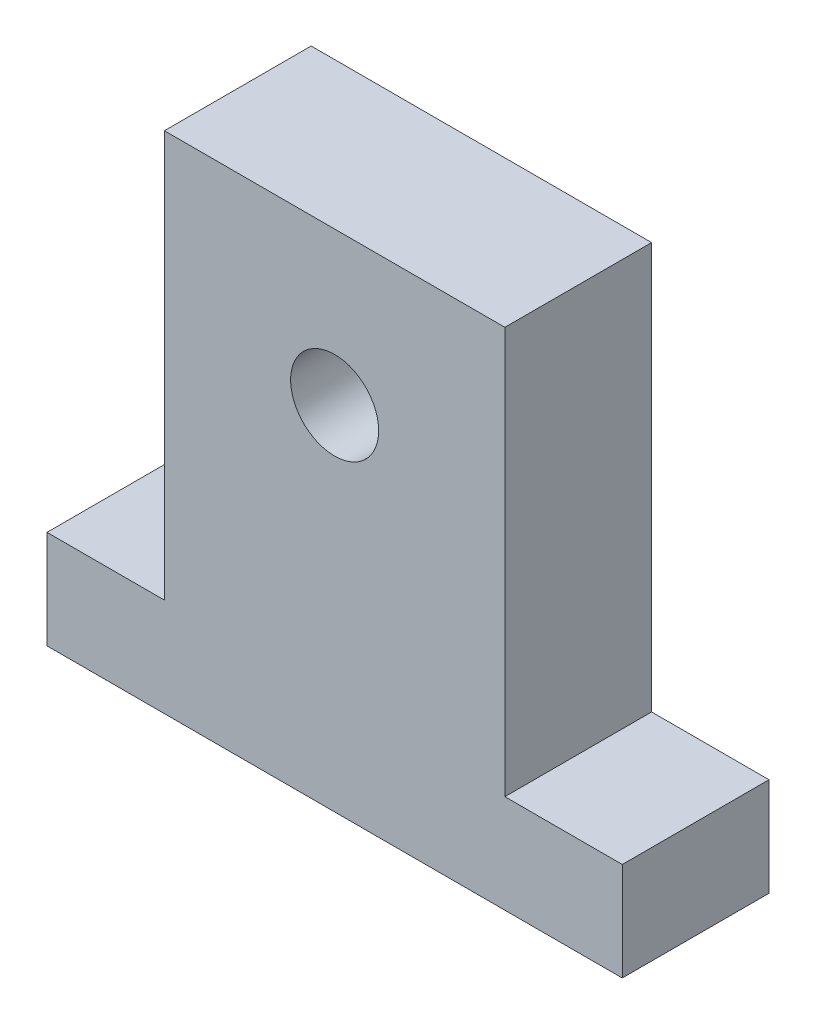
ISO-10303-21;
HEADER;
FILE_DESCRIPTION(('STEP AP214'),'2;1');
FILE_NAME('part.step','',(''),(''),'','','');
FILE_SCHEMA(('AUTOMOTIVE_DESIGN { 1 0 10303 214 1 1 1 1 }'));
ENDSEC;
DATA;
#1=APPLICATION_CONTEXT('core data for automotive mechanical design processes');
#2=APPLICATION_PROTOCOL_DEFINITION('international standard','automotive_design',2000,#1);
#3=PRODUCT_CONTEXT('',#1,'mechanical');
#4=PRODUCT('Part','Part','',(#3));
#5=PRODUCT_RELATED_PRODUCT_CATEGORY('part','',(#4));
#6=PRODUCT_DEFINITION_FORMATION('','',#4);
#7=PRODUCT_DEFINITION_CONTEXT('part definition',#1,'design');
#8=PRODUCT_DEFINITION('design','',#6,#7);
#9=PRODUCT_DEFINITION_SHAPE('','',#8);
#10=(LENGTH_UNIT() NAMED_UNIT(*) SI_UNIT(.MILLI.,.METRE.));
#11=(NAMED_UNIT(*) PLANE_ANGLE_UNIT() SI_UNIT($,.RADIAN.));
#12=(NAMED_UNIT(*) SI_UNIT($,.STERADIAN.) SOLID_ANGLE_UNIT());
#13=UNCERTAINTY_MEASURE_WITH_UNIT(LENGTH_MEASURE(1.E-05),#10,'distance_accuracy_value','');
#14=(GEOMETRIC_REPRESENTATION_CONTEXT(3) GLOBAL_UNCERTAINTY_ASSIGNED_CONTEXT((#13)) GLOBAL_UNIT_ASSIGNED_CONTEXT((#10,
#11,#12)) REPRESENTATION_CONTEXT('',''));
#15=CARTESIAN_POINT('',(0.,0.,0.));
#16=DIRECTION('',(0.,0.,1.));
#17=DIRECTION('',(1.,0.,0.));
#18=AXIS2_PLACEMENT_3D('',#15,#16,#17);
#19=CARTESIAN_POINT('',(0.,0.,10.));
#20=DIRECTION('',(0.,0.,-1.));
#21=DIRECTION('',(-1.,0.,0.));
#22=AXIS2_PLACEMENT_3D('',#19,#20,#21);
#23=PLANE('',#22);
#24=DIRECTION('',(1.,0.,0.));
#25=VECTOR('',#24,1.);
#26=CARTESIAN_POINT('',(19.6,0.,10.));
#27=LINE('',#26,#25);
#28=CARTESIAN_POINT('',(-19.6,0.,10.));
#29=VERTEX_POINT('',#28);
#30=CARTESIAN_POINT('',(19.6,0.,10.));
#31=VERTEX_POINT('',#30);
#32=EDGE_CURVE('E145',#29,#31,#27,.T.);
#33=ORIENTED_EDGE('',*,*,#32,.T.);
#34=DIRECTION('',(0.,1.,0.));
#35=VECTOR('',#34,1.);
#36=CARTESIAN_POINT('',(19.6,6.7,10.));
#37=LINE('',#36,#35);
#38=CARTESIAN_POINT('',(19.6,6.7,10.));
#39=VERTEX_POINT('',#38);
#40=EDGE_CURVE('E93',#31,#39,#37,.T.);
#41=ORIENTED_EDGE('',*,*,#40,.T.);
#42=DIRECTION('',(-1.,0.,0.));
#43=VECTOR('',#42,1.);
#44=CARTESIAN_POINT('',(11.6,6.7,10.));
#45=LINE('',#44,#43);
#46=CARTESIAN_POINT('',(11.6,6.7,10.));
#47=VERTEX_POINT('',#46);
#48=EDGE_CURVE('E160',#39,#47,#45,.T.);
#49=ORIENTED_EDGE('',*,*,#48,.T.);
#50=DIRECTION('',(0.,1.,0.));
#51=VECTOR('',#50,1.);
#52=CARTESIAN_POINT('',(11.6,34.4,10.));
#53=LINE('',#52,#51);
#54=CARTESIAN_POINT('',(11.6,34.4,10.));
#55=VERTEX_POINT('',#54);
#56=EDGE_CURVE('E173',#47,#55,#53,.T.);
#57=ORIENTED_EDGE('',*,*,#56,.T.);
#58=DIRECTION('',(-1.,0.,0.));
#59=VECTOR('',#58,1.);
#60=CARTESIAN_POINT('',(-11.6,34.4,10.));
#61=LINE('',#60,#59);
#62=CARTESIAN_POINT('',(-11.6,34.4,10.));
#63=VERTEX_POINT('',#62);
#64=EDGE_CURVE('E112',#55,#63,#61,.T.);
#65=ORIENTED_EDGE('',*,*,#64,.T.);
#66=DIRECTION('',(0.,-1.,0.));
#67=VECTOR('',#66,1.);
#68=CARTESIAN_POINT('',(-11.6,6.7,10.));
#69=LINE('',#68,#67);
#70=CARTESIAN_POINT('',(-11.6,6.7,10.));
#71=VERTEX_POINT('',#70);
#72=EDGE_CURVE('E106',#63,#71,#69,.T.);
#73=ORIENTED_EDGE('',*,*,#72,.T.);
#74=DIRECTION('',(-1.,0.,0.));
#75=VECTOR('',#74,1.);
#76=CARTESIAN_POINT('',(-19.6,6.7,10.));
#77=LINE('',#76,#75);
#78=CARTESIAN_POINT('',(-19.6,6.7,10.));
#79=VERTEX_POINT('',#78);
#80=EDGE_CURVE('E110',#71,#79,#77,.T.);
#81=ORIENTED_EDGE('',*,*,#80,.T.);
#82=DIRECTION('',(0.,-1.,0.));
#83=VECTOR('',#82,1.);
#84=CARTESIAN_POINT('',(-19.6,0.,10.));
#85=LINE('',#84,#83);
#86=EDGE_CURVE('E50',#79,#29,#85,.T.);
#87=ORIENTED_EDGE('',*,*,#86,.T.);
#88=EDGE_LOOP('',(#33,#41,#49,#57,#65,#73,#81,#87));
#89=FACE_BOUND('',#88,.T.);
#90=CARTESIAN_POINT('',(0.,24.,10.));
#91=DIRECTION('',(0.,0.,1.));
#92=DIRECTION('',(1.,0.,0.));
#93=AXIS2_PLACEMENT_3D('',#90,#91,#92);
#94=CIRCLE('',#93,3.);
#95=CARTESIAN_POINT('',(3.,24.,10.));
#96=VERTEX_POINT('',#95);
#97=EDGE_CURVE('E134',#96,#96,#94,.T.);
#98=ORIENTED_EDGE('',*,*,#97,.F.);
#99=EDGE_LOOP('',(#98));
#100=FACE_BOUND('',#99,.T.);
#101=ADVANCED_FACE('F33',(#89,#100),#23,.F.);
#102=CARTESIAN_POINT('',(0.,0.,0.));
#103=DIRECTION('',(0.,0.,-1.));
#104=DIRECTION('',(-1.,0.,0.));
#105=AXIS2_PLACEMENT_3D('',#102,#103,#104);
#106=PLANE('',#105);
#107=DIRECTION('',(1.,0.,0.));
#108=VECTOR('',#107,1.);
#109=CARTESIAN_POINT('',(19.6,0.,0.));
#110=LINE('',#109,#108);
#111=CARTESIAN_POINT('',(-19.6,0.,0.));
#112=VERTEX_POINT('',#111);
#113=CARTESIAN_POINT('',(19.6,0.,0.));
#114=VERTEX_POINT('',#113);
#115=EDGE_CURVE('E130',#112,#114,#110,.T.);
#116=ORIENTED_EDGE('',*,*,#115,.F.);
#117=DIRECTION('',(0.,-1.,0.));
#118=VECTOR('',#117,1.);
#119=CARTESIAN_POINT('',(-19.6,0.,0.));
#120=LINE('',#119,#118);
#121=CARTESIAN_POINT('',(-19.6,6.7,0.));
#122=VERTEX_POINT('',#121);
#123=EDGE_CURVE('E85',#122,#112,#120,.T.);
#124=ORIENTED_EDGE('',*,*,#123,.F.);
#125=DIRECTION('',(-1.,0.,0.));
#126=VECTOR('',#125,1.);
#127=CARTESIAN_POINT('',(-19.6,6.7,0.));
#128=LINE('',#127,#126);
#129=CARTESIAN_POINT('',(-11.6,6.7,0.));
#130=VERTEX_POINT('',#129);
#131=EDGE_CURVE('E79',#130,#122,#128,.T.);
#132=ORIENTED_EDGE('',*,*,#131,.F.);
#133=DIRECTION('',(0.,-1.,0.));
#134=VECTOR('',#133,1.);
#135=CARTESIAN_POINT('',(-11.6,6.7,0.));
#136=LINE('',#135,#134);
#137=CARTESIAN_POINT('',(-11.6,34.4,0.));
#138=VERTEX_POINT('',#137);
#139=EDGE_CURVE('E120',#138,#130,#136,.T.);
#140=ORIENTED_EDGE('',*,*,#139,.F.);
#141=DIRECTION('',(-1.,0.,0.));
#142=VECTOR('',#141,1.);
#143=CARTESIAN_POINT('',(-11.6,34.4,0.));
#144=LINE('',#143,#142);
#145=CARTESIAN_POINT('',(11.6,34.4,0.));
#146=VERTEX_POINT('',#145);
#147=EDGE_CURVE('E140',#146,#138,#144,.T.);
#148=ORIENTED_EDGE('',*,*,#147,.F.);
#149=DIRECTION('',(0.,1.,0.));
#150=VECTOR('',#149,1.);
#151=CARTESIAN_POINT('',(11.6,34.4,0.));
#152=LINE('',#151,#150);
#153=CARTESIAN_POINT('',(11.6,6.7,0.));
#154=VERTEX_POINT('',#153);
#155=EDGE_CURVE('E138',#154,#146,#152,.T.);
#156=ORIENTED_EDGE('',*,*,#155,.F.);
#157=DIRECTION('',(-1.,0.,0.));
#158=VECTOR('',#157,1.);
#159=CARTESIAN_POINT('',(11.6,6.7,0.));
#160=LINE('',#159,#158);
#161=CARTESIAN_POINT('',(19.6,6.7,0.));
#162=VERTEX_POINT('',#161);
#163=EDGE_CURVE('E136',#162,#154,#160,.T.);
#164=ORIENTED_EDGE('',*,*,#163,.F.);
#165=DIRECTION('',(0.,1.,0.));
#166=VECTOR('',#165,1.);
#167=CARTESIAN_POINT('',(19.6,6.7,0.));
#168=LINE('',#167,#166);
#169=EDGE_CURVE('E133',#114,#162,#168,.T.);
#170=ORIENTED_EDGE('',*,*,#169,.F.);
#171=EDGE_LOOP('',(#116,#124,#132,#140,#148,#156,#164,#170));
#172=FACE_BOUND('',#171,.T.);
#173=CARTESIAN_POINT('',(0.,24.,0.));
#174=DIRECTION('',(0.,0.,1.));
#175=DIRECTION('',(1.,0.,0.));
#176=AXIS2_PLACEMENT_3D('',#173,#174,#175);
#177=CIRCLE('',#176,3.);
#178=CARTESIAN_POINT('',(3.,24.,0.));
#179=VERTEX_POINT('',#178);
#180=EDGE_CURVE('E179',#179,#179,#177,.T.);
#181=ORIENTED_EDGE('',*,*,#180,.T.);
#182=EDGE_LOOP('',(#181));
#183=FACE_BOUND('',#182,.T.);
#184=ADVANCED_FACE('F164',(#172,#183),#106,.T.);
#185=CARTESIAN_POINT('',(19.6,0.,10.));
#186=DIRECTION('',(0.,1.,0.));
#187=DIRECTION('',(-1.,0.,0.));
#188=AXIS2_PLACEMENT_3D('',#185,#186,#187);
#189=PLANE('',#188);
#190=ORIENTED_EDGE('',*,*,#115,.T.);
#191=DIRECTION('',(0.,0.,-1.));
#192=VECTOR('',#191,1.);
#193=CARTESIAN_POINT('',(19.6,0.,10.));
#194=LINE('',#193,#192);
#195=EDGE_CURVE('E11',#31,#114,#194,.T.);
#196=ORIENTED_EDGE('',*,*,#195,.F.);
#197=ORIENTED_EDGE('',*,*,#32,.F.);
#198=DIRECTION('',(0.,0.,-1.));
#199=VECTOR('',#198,1.);
#200=CARTESIAN_POINT('',(-19.6,0.,10.));
#201=LINE('',#200,#199);
#202=EDGE_CURVE('E126',#29,#112,#201,.T.);
#203=ORIENTED_EDGE('',*,*,#202,.T.);
#204=EDGE_LOOP('',(#190,#196,#197,#203));
#205=FACE_BOUND('',#204,.T.);
#206=ADVANCED_FACE('F35',(#205),#189,.F.);
#207=CARTESIAN_POINT('',(19.6,6.7,10.));
#208=DIRECTION('',(-1.,0.,0.));
#209=DIRECTION('',(0.,0.,1.));
#210=AXIS2_PLACEMENT_3D('',#207,#208,#209);
#211=PLANE('',#210);
#212=ORIENTED_EDGE('',*,*,#169,.T.);
#213=DIRECTION('',(0.,0.,-1.));
#214=VECTOR('',#213,1.);
#215=CARTESIAN_POINT('',(19.6,6.7,10.));
#216=LINE('',#215,#214);
#217=EDGE_CURVE('E42',#39,#162,#216,.T.);
#218=ORIENTED_EDGE('',*,*,#217,.F.);
#219=ORIENTED_EDGE('',*,*,#40,.F.);
#220=ORIENTED_EDGE('',*,*,#195,.T.);
#221=EDGE_LOOP('',(#212,#218,#219,#220));
#222=FACE_BOUND('',#221,.T.);
#223=ADVANCED_FACE('F207',(#222),#211,.F.);
#224=CARTESIAN_POINT('',(11.6,6.7,10.));
#225=DIRECTION('',(0.,-1.,0.));
#226=DIRECTION('',(1.,0.,0.));
#227=AXIS2_PLACEMENT_3D('',#224,#225,#226);
#228=PLANE('',#227);
#229=ORIENTED_EDGE('',*,*,#163,.T.);
#230=DIRECTION('',(0.,0.,-1.));
#231=VECTOR('',#230,1.);
#232=CARTESIAN_POINT('',(11.6,6.7,10.));
#233=LINE('',#232,#231);
#234=EDGE_CURVE('E152',#47,#154,#233,.T.);
#235=ORIENTED_EDGE('',*,*,#234,.F.);
#236=ORIENTED_EDGE('',*,*,#48,.F.);
#237=ORIENTED_EDGE('',*,*,#217,.T.);
#238=EDGE_LOOP('',(#229,#235,#236,#237));
#239=FACE_BOUND('',#238,.T.);
#240=ADVANCED_FACE('F158',(#239),#228,.F.);
#241=CARTESIAN_POINT('',(11.6,34.4,10.));
#242=DIRECTION('',(-1.,0.,0.));
#243=DIRECTION('',(0.,-1.,0.));
#244=AXIS2_PLACEMENT_3D('',#241,#242,#243);
#245=PLANE('',#244);
#246=ORIENTED_EDGE('',*,*,#155,.T.);
#247=DIRECTION('',(0.,0.,-1.));
#248=VECTOR('',#247,1.);
#249=CARTESIAN_POINT('',(11.6,34.4,10.));
#250=LINE('',#249,#248);
#251=EDGE_CURVE('E149',#55,#146,#250,.T.);
#252=ORIENTED_EDGE('',*,*,#251,.F.);
#253=ORIENTED_EDGE('',*,*,#56,.F.);
#254=ORIENTED_EDGE('',*,*,#234,.T.);
#255=EDGE_LOOP('',(#246,#252,#253,#254));
#256=FACE_BOUND('',#255,.T.);
#257=ADVANCED_FACE('F169',(#256),#245,.F.);
#258=CARTESIAN_POINT('',(-11.6,34.4,10.));
#259=DIRECTION('',(0.,-1.,0.));
#260=DIRECTION('',(0.,0.,-1.));
#261=AXIS2_PLACEMENT_3D('',#258,#259,#260);
#262=PLANE('',#261);
#263=ORIENTED_EDGE('',*,*,#147,.T.);
#264=DIRECTION('',(0.,0.,-1.));
#265=VECTOR('',#264,1.);
#266=CARTESIAN_POINT('',(-11.6,34.4,10.));
#267=LINE('',#266,#265);
#268=EDGE_CURVE('E121',#63,#138,#267,.T.);
#269=ORIENTED_EDGE('',*,*,#268,.F.);
#270=ORIENTED_EDGE('',*,*,#64,.F.);
#271=ORIENTED_EDGE('',*,*,#251,.T.);
#272=EDGE_LOOP('',(#263,#269,#270,#271));
#273=FACE_BOUND('',#272,.T.);
#274=ADVANCED_FACE('F172',(#273),#262,.F.);
#275=CARTESIAN_POINT('',(-11.6,6.7,10.));
#276=DIRECTION('',(1.,0.,0.));
#277=DIRECTION('',(0.,0.,-1.));
#278=AXIS2_PLACEMENT_3D('',#275,#276,#277);
#279=PLANE('',#278);
#280=ORIENTED_EDGE('',*,*,#139,.T.);
#281=DIRECTION('',(0.,0.,-1.));
#282=VECTOR('',#281,1.);
#283=CARTESIAN_POINT('',(-11.6,6.7,10.));
#284=LINE('',#283,#282);
#285=EDGE_CURVE('E117',#71,#130,#284,.T.);
#286=ORIENTED_EDGE('',*,*,#285,.F.);
#287=ORIENTED_EDGE('',*,*,#72,.F.);
#288=ORIENTED_EDGE('',*,*,#268,.T.);
#289=EDGE_LOOP('',(#280,#286,#287,#288));
#290=FACE_BOUND('',#289,.T.);
#291=ADVANCED_FACE('F118',(#290),#279,.F.);
#292=CARTESIAN_POINT('',(-19.6,6.7,10.));
#293=DIRECTION('',(0.,-1.,0.));
#294=DIRECTION('',(0.,0.,-1.));
#295=AXIS2_PLACEMENT_3D('',#292,#293,#294);
#296=PLANE('',#295);
#297=ORIENTED_EDGE('',*,*,#131,.T.);
#298=DIRECTION('',(0.,0.,-1.));
#299=VECTOR('',#298,1.);
#300=CARTESIAN_POINT('',(-19.6,6.7,10.));
#301=LINE('',#300,#299);
#302=EDGE_CURVE('E122',#79,#122,#301,.T.);
#303=ORIENTED_EDGE('',*,*,#302,.F.);
#304=ORIENTED_EDGE('',*,*,#80,.F.);
#305=ORIENTED_EDGE('',*,*,#285,.T.);
#306=EDGE_LOOP('',(#297,#303,#304,#305));
#307=FACE_BOUND('',#306,.T.);
#308=ADVANCED_FACE('F124',(#307),#296,.F.);
#309=CARTESIAN_POINT('',(-19.6,0.,10.));
#310=DIRECTION('',(1.,0.,0.));
#311=DIRECTION('',(0.,0.,-1.));
#312=AXIS2_PLACEMENT_3D('',#309,#310,#311);
#313=PLANE('',#312);
#314=ORIENTED_EDGE('',*,*,#123,.T.);
#315=ORIENTED_EDGE('',*,*,#202,.F.);
#316=ORIENTED_EDGE('',*,*,#86,.F.);
#317=ORIENTED_EDGE('',*,*,#302,.T.);
#318=EDGE_LOOP('',(#314,#315,#316,#317));
#319=FACE_BOUND('',#318,.T.);
#320=ADVANCED_FACE('F195',(#319),#313,.F.);
#321=CARTESIAN_POINT('',(0.,24.,10.));
#322=DIRECTION('',(0.,0.,-1.));
#323=DIRECTION('',(-1.,0.,0.));
#324=AXIS2_PLACEMENT_3D('',#321,#322,#323);
#325=CYLINDRICAL_SURFACE('',#324,3.);
#326=ORIENTED_EDGE('',*,*,#97,.T.);
#327=EDGE_LOOP('',(#326));
#328=FACE_BOUND('',#327,.T.);
#329=ORIENTED_EDGE('',*,*,#180,.F.);
#330=EDGE_LOOP('',(#329));
#331=FACE_BOUND('',#330,.T.);
#332=ADVANCED_FACE('F185',(#328,#331),#325,.F.);
#333=CLOSED_SHELL('',(#101,#184,#206,#223,#240,#257,#274,#291,#308,#320,#332));
#334=MANIFOLD_SOLID_BREP('B2',#333);
#335=ADVANCED_BREP_SHAPE_REPRESENTATION('',(#18,#334),#14);
#336=SHAPE_DEFINITION_REPRESENTATION(#9,#335);
ENDSEC;
END-ISO-10303-21;
